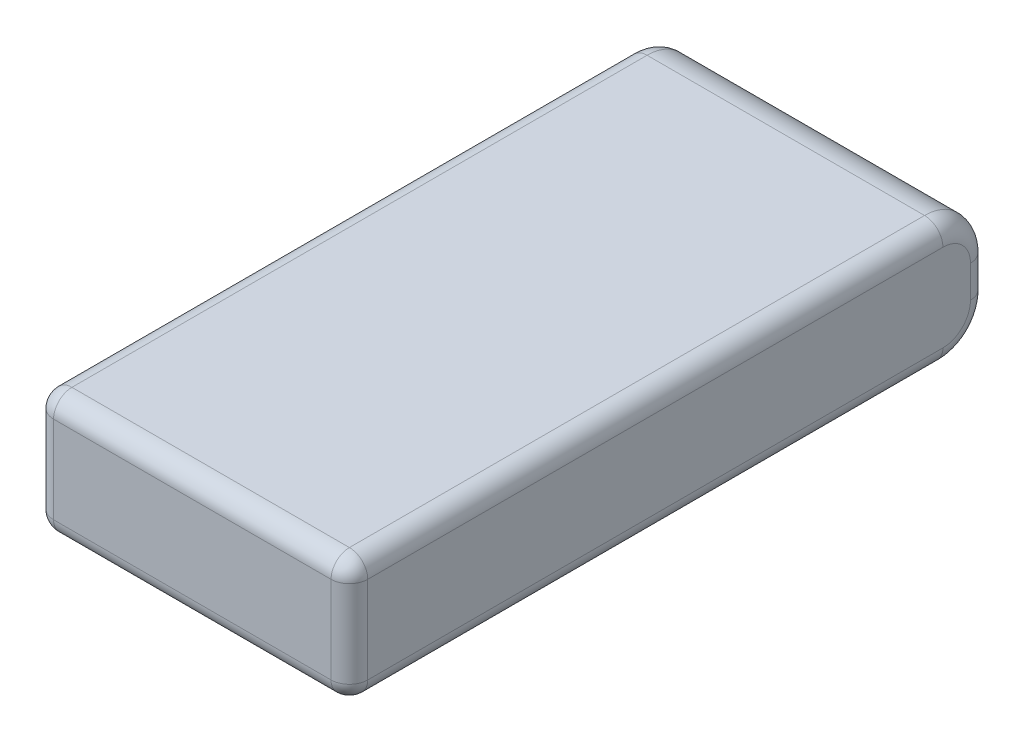
ISO-10303-21;
HEADER;
FILE_DESCRIPTION(('STEP AP214'),'2;1');
FILE_NAME('part.step','',(''),(''),'','','');
FILE_SCHEMA(('AUTOMOTIVE_DESIGN { 1 0 10303 214 1 1 1 1 }'));
ENDSEC;
DATA;
#1=APPLICATION_CONTEXT('core data for automotive mechanical design processes');
#2=APPLICATION_PROTOCOL_DEFINITION('international standard','automotive_design',2000,#1);
#3=PRODUCT_CONTEXT('',#1,'mechanical');
#4=PRODUCT('Part','Part','',(#3));
#5=PRODUCT_RELATED_PRODUCT_CATEGORY('part','',(#4));
#6=PRODUCT_DEFINITION_FORMATION('','',#4);
#7=PRODUCT_DEFINITION_CONTEXT('part definition',#1,'design');
#8=PRODUCT_DEFINITION('design','',#6,#7);
#9=PRODUCT_DEFINITION_SHAPE('','',#8);
#10=(LENGTH_UNIT() NAMED_UNIT(*) SI_UNIT(.MILLI.,.METRE.));
#11=(NAMED_UNIT(*) PLANE_ANGLE_UNIT() SI_UNIT($,.RADIAN.));
#12=(NAMED_UNIT(*) SI_UNIT($,.STERADIAN.) SOLID_ANGLE_UNIT());
#13=UNCERTAINTY_MEASURE_WITH_UNIT(LENGTH_MEASURE(1.E-05),#10,'distance_accuracy_value','');
#14=(GEOMETRIC_REPRESENTATION_CONTEXT(3) GLOBAL_UNCERTAINTY_ASSIGNED_CONTEXT((#13)) GLOBAL_UNIT_ASSIGNED_CONTEXT((#10,
#11,#12)) REPRESENTATION_CONTEXT('',''));
#15=CARTESIAN_POINT('',(0.,0.,0.));
#16=DIRECTION('',(0.,0.,1.));
#17=DIRECTION('',(1.,0.,0.));
#18=AXIS2_PLACEMENT_3D('',#15,#16,#17);
#19=CARTESIAN_POINT('',(0.,13.5,0.));
#20=DIRECTION('',(1.,0.,0.));
#21=DIRECTION('',(0.,0.,-1.));
#22=AXIS2_PLACEMENT_3D('',#19,#20,#21);
#23=PLANE('',#22);
#24=DIRECTION('',(0.,-1.,0.));
#25=VECTOR('',#24,1.);
#26=CARTESIAN_POINT('',(0.,13.5,-67.7));
#27=LINE('',#26,#25);
#28=CARTESIAN_POINT('',(0.,8.5,-67.7));
#29=VERTEX_POINT('',#28);
#30=CARTESIAN_POINT('',(0.,5.,-67.7));
#31=VERTEX_POINT('',#30);
#32=EDGE_CURVE('E250',#29,#31,#27,.T.);
#33=ORIENTED_EDGE('',*,*,#32,.T.);
#34=CARTESIAN_POINT('',(0.,5.,-64.7));
#35=DIRECTION('',(1.,0.,0.));
#36=DIRECTION('',(0.,0.,-1.));
#37=AXIS2_PLACEMENT_3D('',#34,#35,#36);
#38=CIRCLE('',#37,3.);
#39=CARTESIAN_POINT('',(0.,2.,-64.7));
#40=VERTEX_POINT('',#39);
#41=EDGE_CURVE('E252',#31,#40,#38,.F.);
#42=ORIENTED_EDGE('',*,*,#41,.T.);
#43=DIRECTION('',(0.,0.,1.));
#44=VECTOR('',#43,1.);
#45=CARTESIAN_POINT('',(0.,2.,0.));
#46=LINE('',#45,#44);
#47=CARTESIAN_POINT('',(0.,2.,-2.));
#48=VERTEX_POINT('',#47);
#49=EDGE_CURVE('E243',#40,#48,#46,.T.);
#50=ORIENTED_EDGE('',*,*,#49,.T.);
#51=DIRECTION('',(0.,-1.,0.));
#52=VECTOR('',#51,1.);
#53=CARTESIAN_POINT('',(0.,13.5,-2.));
#54=LINE('',#53,#52);
#55=CARTESIAN_POINT('',(0.,11.5,-2.));
#56=VERTEX_POINT('',#55);
#57=EDGE_CURVE('E241',#48,#56,#54,.F.);
#58=ORIENTED_EDGE('',*,*,#57,.T.);
#59=DIRECTION('',(0.,0.,1.));
#60=VECTOR('',#59,1.);
#61=CARTESIAN_POINT('',(0.,11.5,0.));
#62=LINE('',#61,#60);
#63=CARTESIAN_POINT('',(0.,11.5,-64.7));
#64=VERTEX_POINT('',#63);
#65=EDGE_CURVE('E245',#56,#64,#62,.F.);
#66=ORIENTED_EDGE('',*,*,#65,.T.);
#67=CARTESIAN_POINT('',(0.,8.5,-64.7));
#68=DIRECTION('',(1.,0.,0.));
#69=DIRECTION('',(0.,0.,-1.));
#70=AXIS2_PLACEMENT_3D('',#67,#68,#69);
#71=CIRCLE('',#70,3.);
#72=EDGE_CURVE('E247',#64,#29,#71,.F.);
#73=ORIENTED_EDGE('',*,*,#72,.T.);
#74=EDGE_LOOP('',(#33,#42,#50,#58,#66,#73));
#75=FACE_BOUND('',#74,.T.);
#76=ADVANCED_FACE('F37',(#75),#23,.F.);
#77=CARTESIAN_POINT('',(0.,13.5,0.));
#78=DIRECTION('',(0.,0.,-1.));
#79=DIRECTION('',(-1.,0.,0.));
#80=AXIS2_PLACEMENT_3D('',#77,#78,#79);
#81=PLANE('',#80);
#82=DIRECTION('',(1.,0.,0.));
#83=VECTOR('',#82,1.);
#84=CARTESIAN_POINT('',(0.,11.5,0.));
#85=LINE('',#84,#83);
#86=CARTESIAN_POINT('',(32.25,11.5,0.));
#87=VERTEX_POINT('',#86);
#88=CARTESIAN_POINT('',(2.,11.5,0.));
#89=VERTEX_POINT('',#88);
#90=EDGE_CURVE('E46',#87,#89,#85,.F.);
#91=ORIENTED_EDGE('',*,*,#90,.T.);
#92=DIRECTION('',(0.,-1.,0.));
#93=VECTOR('',#92,1.);
#94=CARTESIAN_POINT('',(2.,13.5,0.));
#95=LINE('',#94,#93);
#96=CARTESIAN_POINT('',(2.,2.,0.));
#97=VERTEX_POINT('',#96);
#98=EDGE_CURVE('E11',#89,#97,#95,.T.);
#99=ORIENTED_EDGE('',*,*,#98,.T.);
#100=DIRECTION('',(1.,0.,0.));
#101=VECTOR('',#100,1.);
#102=CARTESIAN_POINT('',(34.25,2.,0.));
#103=LINE('',#102,#101);
#104=CARTESIAN_POINT('',(32.25,2.,0.));
#105=VERTEX_POINT('',#104);
#106=EDGE_CURVE('E260',#97,#105,#103,.T.);
#107=ORIENTED_EDGE('',*,*,#106,.T.);
#108=DIRECTION('',(0.,-1.,0.));
#109=VECTOR('',#108,1.);
#110=CARTESIAN_POINT('',(32.25,13.5,0.));
#111=LINE('',#110,#109);
#112=EDGE_CURVE('E57',#105,#87,#111,.F.);
#113=ORIENTED_EDGE('',*,*,#112,.T.);
#114=EDGE_LOOP('',(#91,#99,#107,#113));
#115=FACE_BOUND('',#114,.T.);
#116=ADVANCED_FACE('F300',(#115),#81,.F.);
#117=CARTESIAN_POINT('',(34.25,13.5,0.));
#118=DIRECTION('',(-1.,0.,0.));
#119=DIRECTION('',(0.,0.,1.));
#120=AXIS2_PLACEMENT_3D('',#117,#118,#119);
#121=PLANE('',#120);
#122=DIRECTION('',(0.,-1.,0.));
#123=VECTOR('',#122,1.);
#124=CARTESIAN_POINT('',(34.25,13.5,-2.));
#125=LINE('',#124,#123);
#126=CARTESIAN_POINT('',(34.25,11.5,-2.));
#127=VERTEX_POINT('',#126);
#128=CARTESIAN_POINT('',(34.25,2.,-2.));
#129=VERTEX_POINT('',#128);
#130=EDGE_CURVE('E147',#127,#129,#125,.T.);
#131=ORIENTED_EDGE('',*,*,#130,.T.);
#132=DIRECTION('',(0.,0.,-1.));
#133=VECTOR('',#132,1.);
#134=CARTESIAN_POINT('',(34.25,2.,-64.7));
#135=LINE('',#134,#133);
#136=CARTESIAN_POINT('',(34.25,2.,-64.7));
#137=VERTEX_POINT('',#136);
#138=EDGE_CURVE('E220',#129,#137,#135,.T.);
#139=ORIENTED_EDGE('',*,*,#138,.T.);
#140=CARTESIAN_POINT('',(34.25,5.,-64.7));
#141=DIRECTION('',(-1.,0.,0.));
#142=DIRECTION('',(0.,0.,1.));
#143=AXIS2_PLACEMENT_3D('',#140,#141,#142);
#144=CIRCLE('',#143,3.);
#145=CARTESIAN_POINT('',(34.25,5.,-67.7));
#146=VERTEX_POINT('',#145);
#147=EDGE_CURVE('E218',#137,#146,#144,.F.);
#148=ORIENTED_EDGE('',*,*,#147,.T.);
#149=DIRECTION('',(0.,-1.,0.));
#150=VECTOR('',#149,1.);
#151=CARTESIAN_POINT('',(34.25,13.5,-67.7));
#152=LINE('',#151,#150);
#153=CARTESIAN_POINT('',(34.25,8.5,-67.7));
#154=VERTEX_POINT('',#153);
#155=EDGE_CURVE('E142',#146,#154,#152,.F.);
#156=ORIENTED_EDGE('',*,*,#155,.T.);
#157=CARTESIAN_POINT('',(34.25,8.5,-64.7));
#158=DIRECTION('',(-1.,0.,0.));
#159=DIRECTION('',(0.,0.,1.));
#160=AXIS2_PLACEMENT_3D('',#157,#158,#159);
#161=CIRCLE('',#160,3.);
#162=CARTESIAN_POINT('',(34.25,11.5,-64.7));
#163=VERTEX_POINT('',#162);
#164=EDGE_CURVE('E136',#154,#163,#161,.F.);
#165=ORIENTED_EDGE('',*,*,#164,.T.);
#166=DIRECTION('',(0.,0.,-1.));
#167=VECTOR('',#166,1.);
#168=CARTESIAN_POINT('',(34.25,11.5,0.));
#169=LINE('',#168,#167);
#170=EDGE_CURVE('E139',#163,#127,#169,.F.);
#171=ORIENTED_EDGE('',*,*,#170,.T.);
#172=EDGE_LOOP('',(#131,#139,#148,#156,#165,#171));
#173=FACE_BOUND('',#172,.T.);
#174=ADVANCED_FACE('F138',(#173),#121,.F.);
#175=CARTESIAN_POINT('',(0.,13.5,-69.7));
#176=DIRECTION('',(0.,0.,1.));
#177=DIRECTION('',(1.,0.,0.));
#178=AXIS2_PLACEMENT_3D('',#175,#176,#177);
#179=PLANE('',#178);
#180=DIRECTION('',(-1.,0.,0.));
#181=VECTOR('',#180,1.);
#182=CARTESIAN_POINT('',(0.,8.5,-69.7));
#183=LINE('',#182,#181);
#184=CARTESIAN_POINT('',(2.,8.5,-69.7));
#185=VERTEX_POINT('',#184);
#186=CARTESIAN_POINT('',(32.25,8.5,-69.7));
#187=VERTEX_POINT('',#186);
#188=EDGE_CURVE('E199',#185,#187,#183,.F.);
#189=ORIENTED_EDGE('',*,*,#188,.T.);
#190=DIRECTION('',(0.,-1.,0.));
#191=VECTOR('',#190,1.);
#192=CARTESIAN_POINT('',(32.25,13.5,-69.7));
#193=LINE('',#192,#191);
#194=CARTESIAN_POINT('',(32.25,5.,-69.7));
#195=VERTEX_POINT('',#194);
#196=EDGE_CURVE('E236',#187,#195,#193,.T.);
#197=ORIENTED_EDGE('',*,*,#196,.T.);
#198=DIRECTION('',(-1.,0.,0.));
#199=VECTOR('',#198,1.);
#200=CARTESIAN_POINT('',(0.,5.,-69.7));
#201=LINE('',#200,#199);
#202=CARTESIAN_POINT('',(2.,5.,-69.7));
#203=VERTEX_POINT('',#202);
#204=EDGE_CURVE('E204',#195,#203,#201,.T.);
#205=ORIENTED_EDGE('',*,*,#204,.T.);
#206=DIRECTION('',(0.,-1.,0.));
#207=VECTOR('',#206,1.);
#208=CARTESIAN_POINT('',(2.,13.5,-69.7));
#209=LINE('',#208,#207);
#210=EDGE_CURVE('E234',#203,#185,#209,.F.);
#211=ORIENTED_EDGE('',*,*,#210,.T.);
#212=EDGE_LOOP('',(#189,#197,#205,#211));
#213=FACE_BOUND('',#212,.T.);
#214=ADVANCED_FACE('F327',(#213),#179,.F.);
#215=CARTESIAN_POINT('',(0.,13.5,-69.7));
#216=DIRECTION('',(0.,-1.,0.));
#217=DIRECTION('',(0.,0.,-1.));
#218=AXIS2_PLACEMENT_3D('',#215,#216,#217);
#219=PLANE('',#218);
#220=DIRECTION('',(-1.,0.,0.));
#221=VECTOR('',#220,1.);
#222=CARTESIAN_POINT('',(0.,13.5,-64.7));
#223=LINE('',#222,#221);
#224=CARTESIAN_POINT('',(32.25,13.5,-64.7));
#225=VERTEX_POINT('',#224);
#226=CARTESIAN_POINT('',(2.,13.5,-64.7));
#227=VERTEX_POINT('',#226);
#228=EDGE_CURVE('E158',#225,#227,#223,.T.);
#229=ORIENTED_EDGE('',*,*,#228,.T.);
#230=DIRECTION('',(0.,0.,1.));
#231=VECTOR('',#230,1.);
#232=CARTESIAN_POINT('',(2.,13.5,-69.7));
#233=LINE('',#232,#231);
#234=CARTESIAN_POINT('',(2.,13.5,-2.));
#235=VERTEX_POINT('',#234);
#236=EDGE_CURVE('E258',#227,#235,#233,.T.);
#237=ORIENTED_EDGE('',*,*,#236,.T.);
#238=DIRECTION('',(1.,0.,0.));
#239=VECTOR('',#238,1.);
#240=CARTESIAN_POINT('',(0.,13.5,-2.));
#241=LINE('',#240,#239);
#242=CARTESIAN_POINT('',(32.25,13.5,-2.));
#243=VERTEX_POINT('',#242);
#244=EDGE_CURVE('E256',#235,#243,#241,.T.);
#245=ORIENTED_EDGE('',*,*,#244,.T.);
#246=DIRECTION('',(0.,0.,-1.));
#247=VECTOR('',#246,1.);
#248=CARTESIAN_POINT('',(32.25,13.5,-69.7));
#249=LINE('',#248,#247);
#250=EDGE_CURVE('E254',#243,#225,#249,.T.);
#251=ORIENTED_EDGE('',*,*,#250,.T.);
#252=EDGE_LOOP('',(#229,#237,#245,#251));
#253=FACE_BOUND('',#252,.T.);
#254=ADVANCED_FACE('F336',(#253),#219,.F.);
#255=CARTESIAN_POINT('',(0.,0.,-69.7));
#256=DIRECTION('',(0.,-1.,0.));
#257=DIRECTION('',(0.,0.,-1.));
#258=AXIS2_PLACEMENT_3D('',#255,#256,#257);
#259=PLANE('',#258);
#260=DIRECTION('',(-1.,0.,0.));
#261=VECTOR('',#260,1.);
#262=CARTESIAN_POINT('',(34.25,0.,-64.7));
#263=LINE('',#262,#261);
#264=CARTESIAN_POINT('',(2.,0.,-64.7));
#265=VERTEX_POINT('',#264);
#266=CARTESIAN_POINT('',(32.25,0.,-64.7));
#267=VERTEX_POINT('',#266);
#268=EDGE_CURVE('E209',#265,#267,#263,.F.);
#269=ORIENTED_EDGE('',*,*,#268,.T.);
#270=DIRECTION('',(0.,0.,-1.));
#271=VECTOR('',#270,1.);
#272=CARTESIAN_POINT('',(32.25,0.,0.));
#273=LINE('',#272,#271);
#274=CARTESIAN_POINT('',(32.25,0.,-2.));
#275=VERTEX_POINT('',#274);
#276=EDGE_CURVE('E227',#267,#275,#273,.F.);
#277=ORIENTED_EDGE('',*,*,#276,.T.);
#278=DIRECTION('',(1.,0.,0.));
#279=VECTOR('',#278,1.);
#280=CARTESIAN_POINT('',(0.,0.,-2.));
#281=LINE('',#280,#279);
#282=CARTESIAN_POINT('',(2.,0.,-2.));
#283=VERTEX_POINT('',#282);
#284=EDGE_CURVE('E223',#275,#283,#281,.F.);
#285=ORIENTED_EDGE('',*,*,#284,.T.);
#286=DIRECTION('',(0.,0.,1.));
#287=VECTOR('',#286,1.);
#288=CARTESIAN_POINT('',(2.,0.,-64.7));
#289=LINE('',#288,#287);
#290=EDGE_CURVE('E225',#283,#265,#289,.F.);
#291=ORIENTED_EDGE('',*,*,#290,.T.);
#292=EDGE_LOOP('',(#269,#277,#285,#291));
#293=FACE_BOUND('',#292,.T.);
#294=ADVANCED_FACE('F315',(#293),#259,.T.);
#295=CARTESIAN_POINT('',(0.,5.,-64.7));
#296=DIRECTION('',(1.,0.,0.));
#297=DIRECTION('',(0.,0.,-1.));
#298=AXIS2_PLACEMENT_3D('',#295,#296,#297);
#299=CYLINDRICAL_SURFACE('',#298,5.);
#300=ORIENTED_EDGE('',*,*,#204,.F.);
#301=CARTESIAN_POINT('',(32.25,5.,-64.7));
#302=DIRECTION('',(-1.,0.,0.));
#303=DIRECTION('',(0.,0.,1.));
#304=AXIS2_PLACEMENT_3D('',#301,#302,#303);
#305=CIRCLE('',#304,5.);
#306=EDGE_CURVE('E232',#195,#267,#305,.T.);
#307=ORIENTED_EDGE('',*,*,#306,.T.);
#308=ORIENTED_EDGE('',*,*,#268,.F.);
#309=CARTESIAN_POINT('',(2.,5.,-64.7));
#310=DIRECTION('',(1.,0.,0.));
#311=DIRECTION('',(0.,0.,-1.));
#312=AXIS2_PLACEMENT_3D('',#309,#310,#311);
#313=CIRCLE('',#312,5.);
#314=EDGE_CURVE('E230',#265,#203,#313,.T.);
#315=ORIENTED_EDGE('',*,*,#314,.T.);
#316=EDGE_LOOP('',(#300,#307,#308,#315));
#317=FACE_BOUND('',#316,.T.);
#318=ADVANCED_FACE('F320',(#317),#299,.T.);
#319=CARTESIAN_POINT('',(0.,8.5,-64.7));
#320=DIRECTION('',(-1.,0.,0.));
#321=DIRECTION('',(0.,0.,1.));
#322=AXIS2_PLACEMENT_3D('',#319,#320,#321);
#323=CYLINDRICAL_SURFACE('',#322,5.);
#324=ORIENTED_EDGE('',*,*,#228,.F.);
#325=CARTESIAN_POINT('',(32.25,8.5,-64.7));
#326=DIRECTION('',(-1.,0.,0.));
#327=DIRECTION('',(0.,0.,1.));
#328=AXIS2_PLACEMENT_3D('',#325,#326,#327);
#329=CIRCLE('',#328,5.);
#330=EDGE_CURVE('E161',#225,#187,#329,.T.);
#331=ORIENTED_EDGE('',*,*,#330,.T.);
#332=ORIENTED_EDGE('',*,*,#188,.F.);
#333=CARTESIAN_POINT('',(2.,8.5,-64.7));
#334=DIRECTION('',(1.,0.,0.));
#335=DIRECTION('',(0.,0.,-1.));
#336=AXIS2_PLACEMENT_3D('',#333,#334,#335);
#337=CIRCLE('',#336,5.);
#338=EDGE_CURVE('E238',#185,#227,#337,.T.);
#339=ORIENTED_EDGE('',*,*,#338,.T.);
#340=EDGE_LOOP('',(#324,#331,#332,#339));
#341=FACE_BOUND('',#340,.T.);
#342=ADVANCED_FACE('F331',(#341),#323,.T.);
#343=CARTESIAN_POINT('',(2.,8.5,-64.7));
#344=DIRECTION('',(1.,0.,0.));
#345=DIRECTION('',(0.,0.,-1.));
#346=AXIS2_PLACEMENT_3D('',#343,#344,#345);
#347=TOROIDAL_SURFACE('',#346,3.,2.);
#348=CARTESIAN_POINT('',(2.,11.5,-64.7));
#349=DIRECTION('',(0.,0.,1.));
#350=DIRECTION('',(1.,0.,0.));
#351=AXIS2_PLACEMENT_3D('',#348,#349,#350);
#352=CIRCLE('',#351,2.);
#353=EDGE_CURVE('E192',#227,#64,#352,.T.);
#354=ORIENTED_EDGE('',*,*,#353,.F.);
#355=ORIENTED_EDGE('',*,*,#338,.F.);
#356=CARTESIAN_POINT('',(2.,8.5,-67.7));
#357=DIRECTION('',(0.,-1.,0.));
#358=DIRECTION('',(0.,0.,-1.));
#359=AXIS2_PLACEMENT_3D('',#356,#357,#358);
#360=CIRCLE('',#359,2.);
#361=EDGE_CURVE('E41',#29,#185,#360,.T.);
#362=ORIENTED_EDGE('',*,*,#361,.F.);
#363=ORIENTED_EDGE('',*,*,#72,.F.);
#364=EDGE_LOOP('',(#354,#355,#362,#363));
#365=FACE_BOUND('',#364,.T.);
#366=ADVANCED_FACE('F39',(#365),#347,.T.);
#367=CARTESIAN_POINT('',(2.,13.5,-67.7));
#368=DIRECTION('',(0.,-1.,0.));
#369=DIRECTION('',(0.,0.,-1.));
#370=AXIS2_PLACEMENT_3D('',#367,#368,#369);
#371=CYLINDRICAL_SURFACE('',#370,2.);
#372=ORIENTED_EDGE('',*,*,#361,.T.);
#373=ORIENTED_EDGE('',*,*,#210,.F.);
#374=CARTESIAN_POINT('',(2.,5.,-67.7));
#375=DIRECTION('',(0.,-1.,0.));
#376=DIRECTION('',(0.,0.,-1.));
#377=AXIS2_PLACEMENT_3D('',#374,#375,#376);
#378=CIRCLE('',#377,2.);
#379=EDGE_CURVE('E190',#31,#203,#378,.T.);
#380=ORIENTED_EDGE('',*,*,#379,.F.);
#381=ORIENTED_EDGE('',*,*,#32,.F.);
#382=EDGE_LOOP('',(#372,#373,#380,#381));
#383=FACE_BOUND('',#382,.T.);
#384=ADVANCED_FACE('F326',(#383),#371,.T.);
#385=CARTESIAN_POINT('',(2.,11.5,-69.7));
#386=DIRECTION('',(0.,0.,1.));
#387=DIRECTION('',(1.,0.,0.));
#388=AXIS2_PLACEMENT_3D('',#385,#386,#387);
#389=CYLINDRICAL_SURFACE('',#388,2.);
#390=ORIENTED_EDGE('',*,*,#353,.T.);
#391=ORIENTED_EDGE('',*,*,#65,.F.);
#392=CARTESIAN_POINT('',(2.,11.5,-2.));
#393=DIRECTION('',(0.,0.,1.));
#394=DIRECTION('',(1.,0.,0.));
#395=AXIS2_PLACEMENT_3D('',#392,#393,#394);
#396=CIRCLE('',#395,2.);
#397=EDGE_CURVE('E187',#235,#56,#396,.T.);
#398=ORIENTED_EDGE('',*,*,#397,.F.);
#399=ORIENTED_EDGE('',*,*,#236,.F.);
#400=EDGE_LOOP('',(#390,#391,#398,#399));
#401=FACE_BOUND('',#400,.T.);
#402=ADVANCED_FACE('F334',(#401),#389,.T.);
#403=CARTESIAN_POINT('',(2.,5.,-64.7));
#404=DIRECTION('',(1.,0.,0.));
#405=DIRECTION('',(0.,0.,-1.));
#406=AXIS2_PLACEMENT_3D('',#403,#404,#405);
#407=TOROIDAL_SURFACE('',#406,3.,2.);
#408=ORIENTED_EDGE('',*,*,#379,.T.);
#409=ORIENTED_EDGE('',*,*,#314,.F.);
#410=CARTESIAN_POINT('',(2.,2.,-64.7));
#411=DIRECTION('',(0.,0.,1.));
#412=DIRECTION('',(1.,0.,0.));
#413=AXIS2_PLACEMENT_3D('',#410,#411,#412);
#414=CIRCLE('',#413,2.);
#415=EDGE_CURVE('E184',#40,#265,#414,.T.);
#416=ORIENTED_EDGE('',*,*,#415,.F.);
#417=ORIENTED_EDGE('',*,*,#41,.F.);
#418=EDGE_LOOP('',(#408,#409,#416,#417));
#419=FACE_BOUND('',#418,.T.);
#420=ADVANCED_FACE('F323',(#419),#407,.T.);
#421=CARTESIAN_POINT('',(2.,11.5,-2.));
#422=DIRECTION('',(0.,0.,1.));
#423=DIRECTION('',(1.,0.,0.));
#424=AXIS2_PLACEMENT_3D('',#421,#422,#423);
#425=SPHERICAL_SURFACE('',#424,2.);
#426=CARTESIAN_POINT('',(2.,11.5,-2.));
#427=DIRECTION('',(-1.,0.,0.));
#428=DIRECTION('',(0.,0.,1.));
#429=AXIS2_PLACEMENT_3D('',#426,#427,#428);
#430=CIRCLE('',#429,2.);
#431=EDGE_CURVE('E179',#235,#89,#430,.F.);
#432=ORIENTED_EDGE('',*,*,#431,.F.);
#433=ORIENTED_EDGE('',*,*,#397,.T.);
#434=CARTESIAN_POINT('',(2.,11.5,-2.));
#435=DIRECTION('',(0.,1.,0.));
#436=DIRECTION('',(0.,0.,1.));
#437=AXIS2_PLACEMENT_3D('',#434,#435,#436);
#438=CIRCLE('',#437,2.);
#439=EDGE_CURVE('E181',#89,#56,#438,.F.);
#440=ORIENTED_EDGE('',*,*,#439,.F.);
#441=EDGE_LOOP('',(#432,#433,#440));
#442=FACE_BOUND('',#441,.T.);
#443=ADVANCED_FACE('F294',(#442),#425,.T.);
#444=CARTESIAN_POINT('',(2.,2.,0.));
#445=DIRECTION('',(0.,0.,-1.));
#446=DIRECTION('',(-1.,0.,0.));
#447=AXIS2_PLACEMENT_3D('',#444,#445,#446);
#448=CYLINDRICAL_SURFACE('',#447,2.);
#449=ORIENTED_EDGE('',*,*,#415,.T.);
#450=ORIENTED_EDGE('',*,*,#290,.F.);
#451=CARTESIAN_POINT('',(2.,2.,-2.));
#452=DIRECTION('',(0.,0.,1.));
#453=DIRECTION('',(1.,0.,0.));
#454=AXIS2_PLACEMENT_3D('',#451,#452,#453);
#455=CIRCLE('',#454,2.);
#456=EDGE_CURVE('E176',#48,#283,#455,.T.);
#457=ORIENTED_EDGE('',*,*,#456,.F.);
#458=ORIENTED_EDGE('',*,*,#49,.F.);
#459=EDGE_LOOP('',(#449,#450,#457,#458));
#460=FACE_BOUND('',#459,.T.);
#461=ADVANCED_FACE('F311',(#460),#448,.T.);
#462=CARTESIAN_POINT('',(2.,13.5,-2.));
#463=DIRECTION('',(0.,-1.,0.));
#464=DIRECTION('',(0.,0.,-1.));
#465=AXIS2_PLACEMENT_3D('',#462,#463,#464);
#466=CYLINDRICAL_SURFACE('',#465,2.);
#467=ORIENTED_EDGE('',*,*,#439,.T.);
#468=ORIENTED_EDGE('',*,*,#57,.F.);
#469=CARTESIAN_POINT('',(2.,2.,-2.));
#470=DIRECTION('',(0.,-1.,0.));
#471=DIRECTION('',(0.,0.,-1.));
#472=AXIS2_PLACEMENT_3D('',#469,#470,#471);
#473=CIRCLE('',#472,2.);
#474=EDGE_CURVE('E173',#97,#48,#473,.T.);
#475=ORIENTED_EDGE('',*,*,#474,.F.);
#476=ORIENTED_EDGE('',*,*,#98,.F.);
#477=EDGE_LOOP('',(#467,#468,#475,#476));
#478=FACE_BOUND('',#477,.T.);
#479=ADVANCED_FACE('F299',(#478),#466,.T.);
#480=CARTESIAN_POINT('',(0.,11.5,-2.));
#481=DIRECTION('',(1.,0.,0.));
#482=DIRECTION('',(0.,0.,-1.));
#483=AXIS2_PLACEMENT_3D('',#480,#481,#482);
#484=CYLINDRICAL_SURFACE('',#483,2.);
#485=ORIENTED_EDGE('',*,*,#431,.T.);
#486=ORIENTED_EDGE('',*,*,#90,.F.);
#487=CARTESIAN_POINT('',(32.25,11.5,-2.));
#488=DIRECTION('',(1.,0.,0.));
#489=DIRECTION('',(0.,0.,-1.));
#490=AXIS2_PLACEMENT_3D('',#487,#488,#489);
#491=CIRCLE('',#490,2.);
#492=EDGE_CURVE('E164',#243,#87,#491,.T.);
#493=ORIENTED_EDGE('',*,*,#492,.F.);
#494=ORIENTED_EDGE('',*,*,#244,.F.);
#495=EDGE_LOOP('',(#485,#486,#493,#494));
#496=FACE_BOUND('',#495,.T.);
#497=ADVANCED_FACE('F289',(#496),#484,.T.);
#498=CARTESIAN_POINT('',(32.25,11.5,-69.7));
#499=DIRECTION('',(0.,0.,-1.));
#500=DIRECTION('',(-1.,0.,0.));
#501=AXIS2_PLACEMENT_3D('',#498,#499,#500);
#502=CYLINDRICAL_SURFACE('',#501,2.);
#503=CARTESIAN_POINT('',(32.25,11.5,-64.7));
#504=DIRECTION('',(0.,0.,-1.));
#505=DIRECTION('',(-1.,0.,0.));
#506=AXIS2_PLACEMENT_3D('',#503,#504,#505);
#507=CIRCLE('',#506,2.);
#508=EDGE_CURVE('E153',#225,#163,#507,.T.);
#509=ORIENTED_EDGE('',*,*,#508,.F.);
#510=ORIENTED_EDGE('',*,*,#250,.F.);
#511=CARTESIAN_POINT('',(32.25,11.5,-2.));
#512=DIRECTION('',(0.,0.,1.));
#513=DIRECTION('',(0.,-1.,0.));
#514=AXIS2_PLACEMENT_3D('',#511,#512,#513);
#515=CIRCLE('',#514,2.);
#516=EDGE_CURVE('E156',#127,#243,#515,.T.);
#517=ORIENTED_EDGE('',*,*,#516,.F.);
#518=ORIENTED_EDGE('',*,*,#170,.F.);
#519=EDGE_LOOP('',(#509,#510,#517,#518));
#520=FACE_BOUND('',#519,.T.);
#521=ADVANCED_FACE('F151',(#520),#502,.T.);
#522=CARTESIAN_POINT('',(2.,2.,-2.));
#523=DIRECTION('',(0.,0.,1.));
#524=DIRECTION('',(1.,0.,0.));
#525=AXIS2_PLACEMENT_3D('',#522,#523,#524);
#526=SPHERICAL_SURFACE('',#525,2.);
#527=ORIENTED_EDGE('',*,*,#474,.T.);
#528=ORIENTED_EDGE('',*,*,#456,.T.);
#529=CARTESIAN_POINT('',(2.,2.,-2.));
#530=DIRECTION('',(-1.,0.,0.));
#531=DIRECTION('',(0.,0.,1.));
#532=AXIS2_PLACEMENT_3D('',#529,#530,#531);
#533=CIRCLE('',#532,2.);
#534=EDGE_CURVE('E162',#97,#283,#533,.F.);
#535=ORIENTED_EDGE('',*,*,#534,.F.);
#536=EDGE_LOOP('',(#527,#528,#535));
#537=FACE_BOUND('',#536,.T.);
#538=ADVANCED_FACE('F306',(#537),#526,.T.);
#539=CARTESIAN_POINT('',(32.25,11.5,-2.));
#540=DIRECTION('',(0.,0.,1.));
#541=DIRECTION('',(1.,0.,0.));
#542=AXIS2_PLACEMENT_3D('',#539,#540,#541);
#543=SPHERICAL_SURFACE('',#542,2.);
#544=ORIENTED_EDGE('',*,*,#516,.T.);
#545=ORIENTED_EDGE('',*,*,#492,.T.);
#546=CARTESIAN_POINT('',(32.25,11.5,-2.));
#547=DIRECTION('',(0.,1.,0.));
#548=DIRECTION('',(0.,0.,1.));
#549=AXIS2_PLACEMENT_3D('',#546,#547,#548);
#550=CIRCLE('',#549,2.);
#551=EDGE_CURVE('E167',#127,#87,#550,.F.);
#552=ORIENTED_EDGE('',*,*,#551,.F.);
#553=EDGE_LOOP('',(#544,#545,#552));
#554=FACE_BOUND('',#553,.T.);
#555=ADVANCED_FACE('F285',(#554),#543,.T.);
#556=CARTESIAN_POINT('',(32.25,8.5,-64.7));
#557=DIRECTION('',(-1.,0.,0.));
#558=DIRECTION('',(0.,0.,1.));
#559=AXIS2_PLACEMENT_3D('',#556,#557,#558);
#560=TOROIDAL_SURFACE('',#559,3.,2.);
#561=ORIENTED_EDGE('',*,*,#508,.T.);
#562=ORIENTED_EDGE('',*,*,#164,.F.);
#563=CARTESIAN_POINT('',(32.25,8.5,-67.7));
#564=DIRECTION('',(0.,-1.,0.));
#565=DIRECTION('',(0.,0.,-1.));
#566=AXIS2_PLACEMENT_3D('',#563,#564,#565);
#567=CIRCLE('',#566,2.);
#568=EDGE_CURVE('E277',#187,#154,#567,.T.);
#569=ORIENTED_EDGE('',*,*,#568,.F.);
#570=ORIENTED_EDGE('',*,*,#330,.F.);
#571=EDGE_LOOP('',(#561,#562,#569,#570));
#572=FACE_BOUND('',#571,.T.);
#573=ADVANCED_FACE('F160',(#572),#560,.T.);
#574=CARTESIAN_POINT('',(0.,2.,-2.));
#575=DIRECTION('',(-1.,0.,0.));
#576=DIRECTION('',(0.,0.,1.));
#577=AXIS2_PLACEMENT_3D('',#574,#575,#576);
#578=CYLINDRICAL_SURFACE('',#577,2.);
#579=ORIENTED_EDGE('',*,*,#534,.T.);
#580=ORIENTED_EDGE('',*,*,#284,.F.);
#581=CARTESIAN_POINT('',(32.25,2.,-2.));
#582=DIRECTION('',(1.,0.,0.));
#583=DIRECTION('',(0.,0.,-1.));
#584=AXIS2_PLACEMENT_3D('',#581,#582,#583);
#585=CIRCLE('',#584,2.);
#586=EDGE_CURVE('E274',#105,#275,#585,.T.);
#587=ORIENTED_EDGE('',*,*,#586,.F.);
#588=ORIENTED_EDGE('',*,*,#106,.F.);
#589=EDGE_LOOP('',(#579,#580,#587,#588));
#590=FACE_BOUND('',#589,.T.);
#591=ADVANCED_FACE('F303',(#590),#578,.T.);
#592=CARTESIAN_POINT('',(32.25,13.5,-2.));
#593=DIRECTION('',(0.,-1.,0.));
#594=DIRECTION('',(0.,0.,-1.));
#595=AXIS2_PLACEMENT_3D('',#592,#593,#594);
#596=CYLINDRICAL_SURFACE('',#595,2.);
#597=ORIENTED_EDGE('',*,*,#551,.T.);
#598=ORIENTED_EDGE('',*,*,#112,.F.);
#599=CARTESIAN_POINT('',(32.25,2.,-2.));
#600=DIRECTION('',(0.,-1.,0.));
#601=DIRECTION('',(0.,0.,-1.));
#602=AXIS2_PLACEMENT_3D('',#599,#600,#601);
#603=CIRCLE('',#602,2.);
#604=EDGE_CURVE('E271',#129,#105,#603,.T.);
#605=ORIENTED_EDGE('',*,*,#604,.F.);
#606=ORIENTED_EDGE('',*,*,#130,.F.);
#607=EDGE_LOOP('',(#597,#598,#605,#606));
#608=FACE_BOUND('',#607,.T.);
#609=ADVANCED_FACE('F281',(#608),#596,.T.);
#610=CARTESIAN_POINT('',(32.25,13.5,-67.7));
#611=DIRECTION('',(0.,-1.,0.));
#612=DIRECTION('',(0.,0.,-1.));
#613=AXIS2_PLACEMENT_3D('',#610,#611,#612);
#614=CYLINDRICAL_SURFACE('',#613,2.);
#615=ORIENTED_EDGE('',*,*,#568,.T.);
#616=ORIENTED_EDGE('',*,*,#155,.F.);
#617=CARTESIAN_POINT('',(32.25,5.,-67.7));
#618=DIRECTION('',(0.,-1.,0.));
#619=DIRECTION('',(0.,0.,-1.));
#620=AXIS2_PLACEMENT_3D('',#617,#618,#619);
#621=CIRCLE('',#620,2.);
#622=EDGE_CURVE('E268',#195,#146,#621,.T.);
#623=ORIENTED_EDGE('',*,*,#622,.F.);
#624=ORIENTED_EDGE('',*,*,#196,.F.);
#625=EDGE_LOOP('',(#615,#616,#623,#624));
#626=FACE_BOUND('',#625,.T.);
#627=ADVANCED_FACE('F369',(#626),#614,.T.);
#628=CARTESIAN_POINT('',(32.25,2.,-2.));
#629=DIRECTION('',(0.,0.,1.));
#630=DIRECTION('',(1.,0.,0.));
#631=AXIS2_PLACEMENT_3D('',#628,#629,#630);
#632=SPHERICAL_SURFACE('',#631,2.);
#633=ORIENTED_EDGE('',*,*,#604,.T.);
#634=ORIENTED_EDGE('',*,*,#586,.T.);
#635=CARTESIAN_POINT('',(32.25,2.,-2.));
#636=DIRECTION('',(0.,0.,1.));
#637=DIRECTION('',(1.,0.,0.));
#638=AXIS2_PLACEMENT_3D('',#635,#636,#637);
#639=CIRCLE('',#638,2.);
#640=EDGE_CURVE('E266',#129,#275,#639,.F.);
#641=ORIENTED_EDGE('',*,*,#640,.F.);
#642=EDGE_LOOP('',(#633,#634,#641));
#643=FACE_BOUND('',#642,.T.);
#644=ADVANCED_FACE('F365',(#643),#632,.T.);
#645=CARTESIAN_POINT('',(32.25,5.,-64.7));
#646=DIRECTION('',(-1.,0.,0.));
#647=DIRECTION('',(0.,0.,1.));
#648=AXIS2_PLACEMENT_3D('',#645,#646,#647);
#649=TOROIDAL_SURFACE('',#648,3.,2.);
#650=ORIENTED_EDGE('',*,*,#622,.T.);
#651=ORIENTED_EDGE('',*,*,#147,.F.);
#652=CARTESIAN_POINT('',(32.25,2.,-64.7));
#653=DIRECTION('',(0.,0.,1.));
#654=DIRECTION('',(1.,0.,0.));
#655=AXIS2_PLACEMENT_3D('',#652,#653,#654);
#656=CIRCLE('',#655,2.);
#657=EDGE_CURVE('E264',#267,#137,#656,.T.);
#658=ORIENTED_EDGE('',*,*,#657,.F.);
#659=ORIENTED_EDGE('',*,*,#306,.F.);
#660=EDGE_LOOP('',(#650,#651,#658,#659));
#661=FACE_BOUND('',#660,.T.);
#662=ADVANCED_FACE('F361',(#661),#649,.T.);
#663=CARTESIAN_POINT('',(32.25,2.,0.));
#664=DIRECTION('',(0.,0.,1.));
#665=DIRECTION('',(1.,0.,0.));
#666=AXIS2_PLACEMENT_3D('',#663,#664,#665);
#667=CYLINDRICAL_SURFACE('',#666,2.);
#668=ORIENTED_EDGE('',*,*,#640,.T.);
#669=ORIENTED_EDGE('',*,*,#276,.F.);
#670=ORIENTED_EDGE('',*,*,#657,.T.);
#671=ORIENTED_EDGE('',*,*,#138,.F.);
#672=EDGE_LOOP('',(#668,#669,#670,#671));
#673=FACE_BOUND('',#672,.T.);
#674=ADVANCED_FACE('F358',(#673),#667,.T.);
#675=CLOSED_SHELL('',(#76,#116,#174,#214,#254,#294,#318,#342,#366,#384,#402,#420,#443,#461,#479,
#497,#521,#538,#555,#573,#591,#609,#627,#644,#662,#674));
#676=MANIFOLD_SOLID_BREP('B2',#675);
#677=ADVANCED_BREP_SHAPE_REPRESENTATION('',(#18,#676),#14);
#678=SHAPE_DEFINITION_REPRESENTATION(#9,#677);
ENDSEC;
END-ISO-10303-21;
